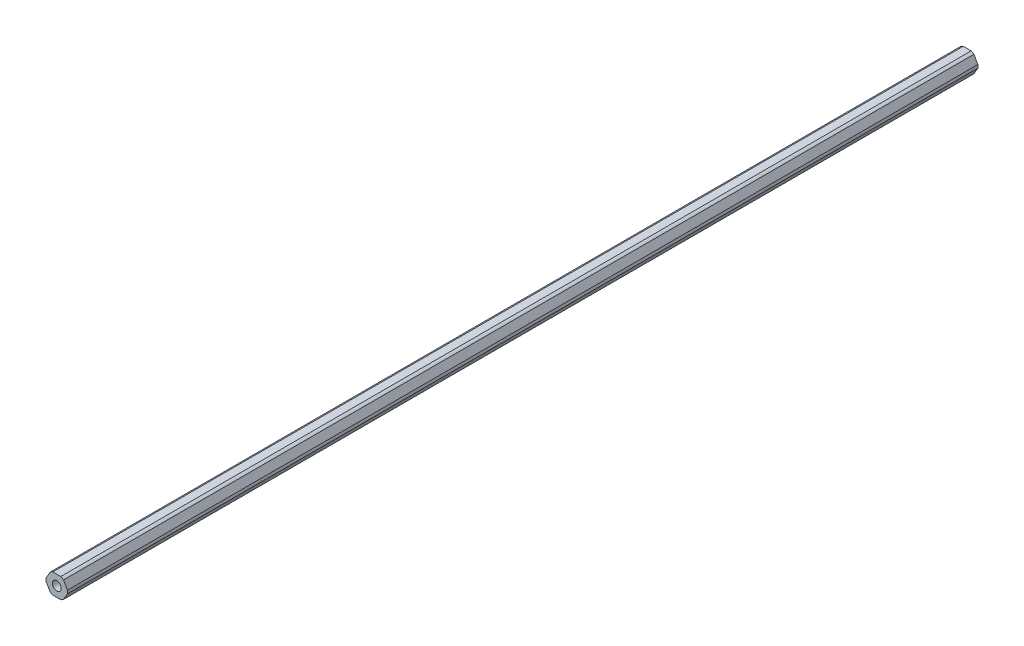
ISO-10303-21;
HEADER;
FILE_DESCRIPTION(('STEP AP214'),'2;1');
FILE_NAME('part.step','',(''),(''),'','','');
FILE_SCHEMA(('AUTOMOTIVE_DESIGN { 1 0 10303 214 1 1 1 1 }'));
ENDSEC;
DATA;
#1=APPLICATION_CONTEXT('core data for automotive mechanical design processes');
#2=APPLICATION_PROTOCOL_DEFINITION('international standard','automotive_design',2000,#1);
#3=PRODUCT_CONTEXT('',#1,'mechanical');
#4=PRODUCT('Part','Part','',(#3));
#5=PRODUCT_RELATED_PRODUCT_CATEGORY('part','',(#4));
#6=PRODUCT_DEFINITION_FORMATION('','',#4);
#7=PRODUCT_DEFINITION_CONTEXT('part definition',#1,'design');
#8=PRODUCT_DEFINITION('design','',#6,#7);
#9=PRODUCT_DEFINITION_SHAPE('','',#8);
#10=(LENGTH_UNIT() NAMED_UNIT(*) SI_UNIT(.MILLI.,.METRE.));
#11=(NAMED_UNIT(*) PLANE_ANGLE_UNIT() SI_UNIT($,.RADIAN.));
#12=(NAMED_UNIT(*) SI_UNIT($,.STERADIAN.) SOLID_ANGLE_UNIT());
#13=UNCERTAINTY_MEASURE_WITH_UNIT(LENGTH_MEASURE(1.E-05),#10,'distance_accuracy_value','');
#14=(GEOMETRIC_REPRESENTATION_CONTEXT(3) GLOBAL_UNCERTAINTY_ASSIGNED_CONTEXT((#13)) GLOBAL_UNIT_ASSIGNED_CONTEXT((#10,
#11,#12)) REPRESENTATION_CONTEXT('',''));
#15=CARTESIAN_POINT('',(0.,0.,0.));
#16=DIRECTION('',(0.,0.,1.));
#17=DIRECTION('',(1.,0.,0.));
#18=AXIS2_PLACEMENT_3D('',#15,#16,#17);
#19=CARTESIAN_POINT('',(2.74963065701564,-4.7625,457.2));
#20=DIRECTION('',(-0.866025403784442,0.5,0.));
#21=DIRECTION('',(0.,0.,1.));
#22=AXIS2_PLACEMENT_3D('',#19,#20,#21);
#23=PLANE('',#22);
#24=DIRECTION('',(0.499999999999991,0.866025403784444,0.));
#25=VECTOR('',#24,1.);
#26=CARTESIAN_POINT('',(3.18463300545771,-4.00905383108654,-254.));
#27=LINE('',#26,#25);
#28=CARTESIAN_POINT('',(3.18463300545771,-4.00905383108654,-254.));
#29=VERTEX_POINT('',#28);
#30=CARTESIAN_POINT('',(5.06425896558911,-0.753446168913433,-254.));
#31=VERTEX_POINT('',#30);
#32=EDGE_CURVE('E233',#29,#31,#27,.T.);
#33=ORIENTED_EDGE('',*,*,#32,.F.);
#34=DIRECTION('',(0.,0.,1.));
#35=VECTOR('',#34,1.);
#36=CARTESIAN_POINT('',(3.1846330054577,-4.00905383108652,-457.2));
#37=LINE('',#36,#35);
#38=CARTESIAN_POINT('',(3.1846330054577,-4.00905383108653,-685.799999999999));
#39=VERTEX_POINT('',#38);
#40=EDGE_CURVE('E244',#39,#29,#37,.T.);
#41=ORIENTED_EDGE('',*,*,#40,.F.);
#42=DIRECTION('',(-0.499999999999995,-0.866025403784442,0.));
#43=VECTOR('',#42,1.);
#44=CARTESIAN_POINT('',(5.06425896558911,-0.753446168913432,-685.799999999999));
#45=LINE('',#44,#43);
#46=CARTESIAN_POINT('',(5.06425896558911,-0.753446168913432,-685.799999999999));
#47=VERTEX_POINT('',#46);
#48=EDGE_CURVE('E206',#47,#39,#45,.T.);
#49=ORIENTED_EDGE('',*,*,#48,.F.);
#50=DIRECTION('',(0.,0.,-1.));
#51=VECTOR('',#50,1.);
#52=CARTESIAN_POINT('',(5.06425896558911,-0.753446168913433,-457.2));
#53=LINE('',#52,#51);
#54=EDGE_CURVE('E261',#31,#47,#53,.T.);
#55=ORIENTED_EDGE('',*,*,#54,.F.);
#56=EDGE_LOOP('',(#33,#41,#49,#55));
#57=FACE_BOUND('',#56,.T.);
#58=ADVANCED_FACE('F46',(#57),#23,.F.);
#59=CARTESIAN_POINT('',(5.49926131403117,0.,457.2));
#60=DIRECTION('',(-0.866025403784438,-0.5,0.));
#61=DIRECTION('',(-0.5,0.866025403784438,0.));
#62=AXIS2_PLACEMENT_3D('',#59,#60,#61);
#63=PLANE('',#62);
#64=DIRECTION('',(-0.500000000000001,0.866025403784438,0.));
#65=VECTOR('',#64,1.);
#66=CARTESIAN_POINT('',(5.06425896558911,0.753446168913416,-254.));
#67=LINE('',#66,#65);
#68=CARTESIAN_POINT('',(5.06425896558911,0.753446168913416,-254.));
#69=VERTEX_POINT('',#68);
#70=CARTESIAN_POINT('',(3.18463300545762,4.00905383108658,-254.));
#71=VERTEX_POINT('',#70);
#72=EDGE_CURVE('E63',#69,#71,#67,.T.);
#73=ORIENTED_EDGE('',*,*,#72,.F.);
#74=DIRECTION('',(0.,0.,1.));
#75=VECTOR('',#74,1.);
#76=CARTESIAN_POINT('',(5.06425896558911,0.753446168913412,-457.2));
#77=LINE('',#76,#75);
#78=CARTESIAN_POINT('',(5.06425896558911,0.753446168913415,-685.799999999999));
#79=VERTEX_POINT('',#78);
#80=EDGE_CURVE('E259',#79,#69,#77,.T.);
#81=ORIENTED_EDGE('',*,*,#80,.F.);
#82=DIRECTION('',(0.499999999999999,-0.866025403784439,0.));
#83=VECTOR('',#82,1.);
#84=CARTESIAN_POINT('',(3.18463300545764,4.00905383108656,-685.799999999999));
#85=LINE('',#84,#83);
#86=CARTESIAN_POINT('',(3.18463300545763,4.00905383108658,-685.799999999999));
#87=VERTEX_POINT('',#86);
#88=EDGE_CURVE('E177',#87,#79,#85,.T.);
#89=ORIENTED_EDGE('',*,*,#88,.F.);
#90=DIRECTION('',(0.,0.,-1.));
#91=VECTOR('',#90,1.);
#92=CARTESIAN_POINT('',(3.18463300545762,4.00905383108658,-457.2));
#93=LINE('',#92,#91);
#94=EDGE_CURVE('E166',#71,#87,#93,.T.);
#95=ORIENTED_EDGE('',*,*,#94,.F.);
#96=EDGE_LOOP('',(#73,#81,#89,#95));
#97=FACE_BOUND('',#96,.T.);
#98=ADVANCED_FACE('F287',(#97),#63,.F.);
#99=CARTESIAN_POINT('',(2.74963065701557,4.7625,457.2));
#100=DIRECTION('',(0.,-1.,0.));
#101=DIRECTION('',(0.,0.,-1.));
#102=AXIS2_PLACEMENT_3D('',#99,#100,#101);
#103=PLANE('',#102);
#104=DIRECTION('',(-1.,0.,0.));
#105=VECTOR('',#104,1.);
#106=CARTESIAN_POINT('',(1.87962596013146,4.76249999999999,-254.));
#107=LINE('',#106,#105);
#108=CARTESIAN_POINT('',(1.87962596013146,4.76249999999999,-254.));
#109=VERTEX_POINT('',#108);
#110=CARTESIAN_POINT('',(-1.8796259601315,4.7625,-254.));
#111=VERTEX_POINT('',#110);
#112=EDGE_CURVE('E163',#109,#111,#107,.T.);
#113=ORIENTED_EDGE('',*,*,#112,.F.);
#114=DIRECTION('',(0.,0.,1.));
#115=VECTOR('',#114,1.);
#116=CARTESIAN_POINT('',(1.87962596013147,4.7625,-457.2));
#117=LINE('',#116,#115);
#118=CARTESIAN_POINT('',(1.87962596013146,4.76249999999999,-685.799999999999));
#119=VERTEX_POINT('',#118);
#120=EDGE_CURVE('E156',#119,#109,#117,.T.);
#121=ORIENTED_EDGE('',*,*,#120,.F.);
#122=DIRECTION('',(1.,0.,0.));
#123=VECTOR('',#122,1.);
#124=CARTESIAN_POINT('',(-1.87962596013148,4.76249999999999,-685.799999999999));
#125=LINE('',#124,#123);
#126=CARTESIAN_POINT('',(-1.8796259601315,4.76249999999999,-685.799999999999));
#127=VERTEX_POINT('',#126);
#128=EDGE_CURVE('E161',#127,#119,#125,.T.);
#129=ORIENTED_EDGE('',*,*,#128,.F.);
#130=DIRECTION('',(0.,0.,-1.));
#131=VECTOR('',#130,1.);
#132=CARTESIAN_POINT('',(-1.8796259601315,4.7625,-457.2));
#133=LINE('',#132,#131);
#134=EDGE_CURVE('E241',#111,#127,#133,.T.);
#135=ORIENTED_EDGE('',*,*,#134,.F.);
#136=EDGE_LOOP('',(#113,#121,#129,#135));
#137=FACE_BOUND('',#136,.T.);
#138=ADVANCED_FACE('F158',(#137),#103,.F.);
#139=CARTESIAN_POINT('',(-2.7496306570156,4.7625,457.2));
#140=DIRECTION('',(0.866025403784442,-0.5,0.));
#141=DIRECTION('',(0.,0.,-1.));
#142=AXIS2_PLACEMENT_3D('',#139,#140,#141);
#143=PLANE('',#142);
#144=DIRECTION('',(-0.499999999999993,-0.866025403784443,0.));
#145=VECTOR('',#144,1.);
#146=CARTESIAN_POINT('',(-3.18463300545766,4.00905383108656,-254.));
#147=LINE('',#146,#145);
#148=CARTESIAN_POINT('',(-3.18463300545767,4.00905383108657,-254.));
#149=VERTEX_POINT('',#148);
#150=CARTESIAN_POINT('',(-5.06425896558912,0.753446168913382,-254.));
#151=VERTEX_POINT('',#150);
#152=EDGE_CURVE('E221',#149,#151,#147,.T.);
#153=ORIENTED_EDGE('',*,*,#152,.F.);
#154=DIRECTION('',(0.,0.,1.));
#155=VECTOR('',#154,1.);
#156=CARTESIAN_POINT('',(-3.18463300545766,4.00905383108655,-457.2));
#157=LINE('',#156,#155);
#158=CARTESIAN_POINT('',(-3.18463300545766,4.00905383108656,-685.799999999999));
#159=VERTEX_POINT('',#158);
#160=EDGE_CURVE('E246',#159,#149,#157,.T.);
#161=ORIENTED_EDGE('',*,*,#160,.F.);
#162=DIRECTION('',(0.499999999999995,0.866025403784441,0.));
#163=VECTOR('',#162,1.);
#164=CARTESIAN_POINT('',(-5.06425896558912,0.753446168913382,-685.799999999999));
#165=LINE('',#164,#163);
#166=CARTESIAN_POINT('',(-5.06425896558912,0.753446168913381,-685.799999999999));
#167=VERTEX_POINT('',#166);
#168=EDGE_CURVE('E185',#167,#159,#165,.T.);
#169=ORIENTED_EDGE('',*,*,#168,.F.);
#170=DIRECTION('',(0.,0.,-1.));
#171=VECTOR('',#170,1.);
#172=CARTESIAN_POINT('',(-5.06425896558912,0.753446168913382,-457.2));
#173=LINE('',#172,#171);
#174=EDGE_CURVE('E240',#151,#167,#173,.T.);
#175=ORIENTED_EDGE('',*,*,#174,.F.);
#176=EDGE_LOOP('',(#153,#161,#169,#175));
#177=FACE_BOUND('',#176,.T.);
#178=ADVANCED_FACE('F317',(#177),#143,.F.);
#179=CARTESIAN_POINT('',(-5.49926131403117,0.,457.2));
#180=DIRECTION('',(0.866025403784435,0.500000000000007,0.));
#181=DIRECTION('',(0.,0.,-1.));
#182=AXIS2_PLACEMENT_3D('',#179,#180,#181);
#183=PLANE('',#182);
#184=DIRECTION('',(0.500000000000007,-0.866025403784435,0.));
#185=VECTOR('',#184,1.);
#186=CARTESIAN_POINT('',(-5.06425896558911,-0.753446168913448,-254.));
#187=LINE('',#186,#185);
#188=CARTESIAN_POINT('',(-5.06425896558911,-0.753446168913446,-254.));
#189=VERTEX_POINT('',#188);
#190=CARTESIAN_POINT('',(-3.1846330054576,-4.0090538310866,-254.));
#191=VERTEX_POINT('',#190);
#192=EDGE_CURVE('E225',#189,#191,#187,.T.);
#193=ORIENTED_EDGE('',*,*,#192,.F.);
#194=DIRECTION('',(0.,0.,1.));
#195=VECTOR('',#194,1.);
#196=CARTESIAN_POINT('',(-5.06425896558911,-0.75344616891345,-457.2));
#197=LINE('',#196,#195);
#198=CARTESIAN_POINT('',(-5.06425896558911,-0.75344616891345,-685.799999999999));
#199=VERTEX_POINT('',#198);
#200=EDGE_CURVE('E236',#199,#189,#197,.T.);
#201=ORIENTED_EDGE('',*,*,#200,.F.);
#202=DIRECTION('',(-0.500000000000007,0.866025403784434,0.));
#203=VECTOR('',#202,1.);
#204=CARTESIAN_POINT('',(-3.18463300545759,-4.00905383108661,-685.799999999999));
#205=LINE('',#204,#203);
#206=CARTESIAN_POINT('',(-3.1846330054576,-4.0090538310866,-685.799999999999));
#207=VERTEX_POINT('',#206);
#208=EDGE_CURVE('E194',#207,#199,#205,.T.);
#209=ORIENTED_EDGE('',*,*,#208,.F.);
#210=DIRECTION('',(0.,0.,-1.));
#211=VECTOR('',#210,1.);
#212=CARTESIAN_POINT('',(-3.1846330054576,-4.0090538310866,-457.2));
#213=LINE('',#212,#211);
#214=EDGE_CURVE('E245',#191,#207,#213,.T.);
#215=ORIENTED_EDGE('',*,*,#214,.F.);
#216=EDGE_LOOP('',(#193,#201,#209,#215));
#217=FACE_BOUND('',#216,.T.);
#218=ADVANCED_FACE('F308',(#217),#183,.F.);
#219=CARTESIAN_POINT('',(-2.74963065701554,-4.7625,457.2));
#220=DIRECTION('',(0.,1.,0.));
#221=DIRECTION('',(1.,0.,0.));
#222=AXIS2_PLACEMENT_3D('',#219,#220,#221);
#223=PLANE('',#222);
#224=DIRECTION('',(1.,0.,0.));
#225=VECTOR('',#224,1.);
#226=CARTESIAN_POINT('',(-1.87962596013144,-4.7625,-254.));
#227=LINE('',#226,#225);
#228=CARTESIAN_POINT('',(-1.87962596013144,-4.7625,-254.));
#229=VERTEX_POINT('',#228);
#230=CARTESIAN_POINT('',(1.87962596013154,-4.7625,-254.));
#231=VERTEX_POINT('',#230);
#232=EDGE_CURVE('E229',#229,#231,#227,.T.);
#233=ORIENTED_EDGE('',*,*,#232,.F.);
#234=DIRECTION('',(0.,0.,1.));
#235=VECTOR('',#234,1.);
#236=CARTESIAN_POINT('',(-1.87962596013144,-4.7625,-457.2));
#237=LINE('',#236,#235);
#238=CARTESIAN_POINT('',(-1.87962596013143,-4.7625,-685.799999999999));
#239=VERTEX_POINT('',#238);
#240=EDGE_CURVE('E249',#239,#229,#237,.T.);
#241=ORIENTED_EDGE('',*,*,#240,.F.);
#242=DIRECTION('',(-1.,0.,0.));
#243=VECTOR('',#242,1.);
#244=CARTESIAN_POINT('',(1.87962596013155,-4.76249999999998,-685.799999999999));
#245=LINE('',#244,#243);
#246=CARTESIAN_POINT('',(1.87962596013153,-4.76249999999998,-685.799999999999));
#247=VERTEX_POINT('',#246);
#248=EDGE_CURVE('E200',#247,#239,#245,.T.);
#249=ORIENTED_EDGE('',*,*,#248,.F.);
#250=DIRECTION('',(0.,0.,-1.));
#251=VECTOR('',#250,1.);
#252=CARTESIAN_POINT('',(1.87962596013154,-4.7625,-457.2));
#253=LINE('',#252,#251);
#254=EDGE_CURVE('E242',#231,#247,#253,.T.);
#255=ORIENTED_EDGE('',*,*,#254,.F.);
#256=EDGE_LOOP('',(#233,#241,#249,#255));
#257=FACE_BOUND('',#256,.T.);
#258=ADVANCED_FACE('F300',(#257),#223,.F.);
#259=CARTESIAN_POINT('',(0.,0.,-457.2));
#260=DIRECTION('',(0.,0.,1.));
#261=DIRECTION('',(1.,0.,0.));
#262=AXIS2_PLACEMENT_3D('',#259,#260,#261);
#263=CYLINDRICAL_SURFACE('',#262,5.12);
#264=ORIENTED_EDGE('',*,*,#80,.T.);
#265=CARTESIAN_POINT('',(0.,0.,-254.));
#266=DIRECTION('',(0.,0.,1.));
#267=DIRECTION('',(1.,0.,0.));
#268=AXIS2_PLACEMENT_3D('',#265,#266,#267);
#269=CIRCLE('',#268,5.12);
#270=CARTESIAN_POINT('',(5.12,0.,-254.));
#271=VERTEX_POINT('',#270);
#272=EDGE_CURVE('E176',#271,#69,#269,.T.);
#273=ORIENTED_EDGE('',*,*,#272,.F.);
#274=DIRECTION('',(0.,0.,1.));
#275=VECTOR('',#274,1.);
#276=CARTESIAN_POINT('',(5.12,0.,-457.2));
#277=LINE('',#276,#275);
#278=CARTESIAN_POINT('',(5.12,0.,-457.2));
#279=VERTEX_POINT('',#278);
#280=EDGE_CURVE('E263',#279,#271,#277,.T.);
#281=ORIENTED_EDGE('',*,*,#280,.F.);
#282=ORIENTED_EDGE('',*,*,#280,.T.);
#283=EDGE_CURVE('E213',#31,#271,#269,.T.);
#284=ORIENTED_EDGE('',*,*,#283,.F.);
#285=ORIENTED_EDGE('',*,*,#54,.T.);
#286=CARTESIAN_POINT('',(0.,0.,-685.799999999999));
#287=DIRECTION('',(0.,0.,-1.));
#288=DIRECTION('',(-1.,0.,0.));
#289=AXIS2_PLACEMENT_3D('',#286,#287,#288);
#290=CIRCLE('',#289,5.12);
#291=EDGE_CURVE('E209',#79,#47,#290,.T.);
#292=ORIENTED_EDGE('',*,*,#291,.F.);
#293=EDGE_LOOP('',(#264,#273,#281,#282,#284,#285,#292));
#294=FACE_BOUND('',#293,.T.);
#295=ADVANCED_FACE('F48',(#294),#263,.T.);
#296=CARTESIAN_POINT('',(0.,0.,-457.2));
#297=DIRECTION('',(0.,0.,1.));
#298=DIRECTION('',(1.,0.,0.));
#299=AXIS2_PLACEMENT_3D('',#296,#297,#298);
#300=CYLINDRICAL_SURFACE('',#299,5.12);
#301=ORIENTED_EDGE('',*,*,#40,.T.);
#302=CARTESIAN_POINT('',(0.,0.,-254.));
#303=DIRECTION('',(0.,0.,1.));
#304=DIRECTION('',(1.,0.,0.));
#305=AXIS2_PLACEMENT_3D('',#302,#303,#304);
#306=CIRCLE('',#305,5.12000000000003);
#307=EDGE_CURVE('E231',#231,#29,#306,.T.);
#308=ORIENTED_EDGE('',*,*,#307,.F.);
#309=ORIENTED_EDGE('',*,*,#254,.T.);
#310=CARTESIAN_POINT('',(0.,0.,-685.799999999999));
#311=DIRECTION('',(0.,0.,-1.));
#312=DIRECTION('',(-1.,0.,0.));
#313=AXIS2_PLACEMENT_3D('',#310,#311,#312);
#314=CIRCLE('',#313,5.12000000000001);
#315=EDGE_CURVE('E203',#39,#247,#314,.T.);
#316=ORIENTED_EDGE('',*,*,#315,.F.);
#317=EDGE_LOOP('',(#301,#308,#309,#316));
#318=FACE_BOUND('',#317,.T.);
#319=ADVANCED_FACE('F294',(#318),#300,.T.);
#320=CARTESIAN_POINT('',(0.,0.,-457.2));
#321=DIRECTION('',(0.,0.,1.));
#322=DIRECTION('',(1.,0.,0.));
#323=AXIS2_PLACEMENT_3D('',#320,#321,#322);
#324=CYLINDRICAL_SURFACE('',#323,5.12);
#325=ORIENTED_EDGE('',*,*,#240,.T.);
#326=CARTESIAN_POINT('',(0.,0.,-254.));
#327=DIRECTION('',(0.,0.,1.));
#328=DIRECTION('',(1.,0.,0.));
#329=AXIS2_PLACEMENT_3D('',#326,#327,#328);
#330=CIRCLE('',#329,5.12);
#331=EDGE_CURVE('E227',#191,#229,#330,.T.);
#332=ORIENTED_EDGE('',*,*,#331,.F.);
#333=ORIENTED_EDGE('',*,*,#214,.T.);
#334=CARTESIAN_POINT('',(0.,0.,-685.799999999999));
#335=DIRECTION('',(0.,0.,-1.));
#336=DIRECTION('',(-1.,0.,0.));
#337=AXIS2_PLACEMENT_3D('',#334,#335,#336);
#338=CIRCLE('',#337,5.12);
#339=EDGE_CURVE('E197',#239,#207,#338,.T.);
#340=ORIENTED_EDGE('',*,*,#339,.F.);
#341=EDGE_LOOP('',(#325,#332,#333,#340));
#342=FACE_BOUND('',#341,.T.);
#343=ADVANCED_FACE('F303',(#342),#324,.T.);
#344=CARTESIAN_POINT('',(0.,0.,-457.2));
#345=DIRECTION('',(0.,0.,1.));
#346=DIRECTION('',(1.,0.,0.));
#347=AXIS2_PLACEMENT_3D('',#344,#345,#346);
#348=CYLINDRICAL_SURFACE('',#347,5.12);
#349=ORIENTED_EDGE('',*,*,#200,.T.);
#350=CARTESIAN_POINT('',(0.,0.,-254.));
#351=DIRECTION('',(0.,0.,1.));
#352=DIRECTION('',(1.,0.,0.));
#353=AXIS2_PLACEMENT_3D('',#350,#351,#352);
#354=CIRCLE('',#353,5.12);
#355=EDGE_CURVE('E223',#151,#189,#354,.T.);
#356=ORIENTED_EDGE('',*,*,#355,.F.);
#357=ORIENTED_EDGE('',*,*,#174,.T.);
#358=CARTESIAN_POINT('',(0.,0.,-685.799999999999));
#359=DIRECTION('',(0.,0.,-1.));
#360=DIRECTION('',(-1.,0.,0.));
#361=AXIS2_PLACEMENT_3D('',#358,#359,#360);
#362=CIRCLE('',#361,5.12);
#363=EDGE_CURVE('E191',#199,#167,#362,.T.);
#364=ORIENTED_EDGE('',*,*,#363,.F.);
#365=EDGE_LOOP('',(#349,#356,#357,#364));
#366=FACE_BOUND('',#365,.T.);
#367=ADVANCED_FACE('F312',(#366),#348,.T.);
#368=CARTESIAN_POINT('',(0.,0.,-457.2));
#369=DIRECTION('',(0.,0.,1.));
#370=DIRECTION('',(1.,0.,0.));
#371=AXIS2_PLACEMENT_3D('',#368,#369,#370);
#372=CYLINDRICAL_SURFACE('',#371,5.12);
#373=ORIENTED_EDGE('',*,*,#160,.T.);
#374=CARTESIAN_POINT('',(0.,0.,-254.));
#375=DIRECTION('',(0.,0.,1.));
#376=DIRECTION('',(1.,0.,0.));
#377=AXIS2_PLACEMENT_3D('',#374,#375,#376);
#378=CIRCLE('',#377,5.12000000000002);
#379=EDGE_CURVE('E219',#111,#149,#378,.T.);
#380=ORIENTED_EDGE('',*,*,#379,.F.);
#381=ORIENTED_EDGE('',*,*,#134,.T.);
#382=CARTESIAN_POINT('',(0.,0.,-685.799999999999));
#383=DIRECTION('',(0.,0.,-1.));
#384=DIRECTION('',(-1.,0.,0.));
#385=AXIS2_PLACEMENT_3D('',#382,#383,#384);
#386=CIRCLE('',#385,5.12000000000001);
#387=EDGE_CURVE('E182',#159,#127,#386,.T.);
#388=ORIENTED_EDGE('',*,*,#387,.F.);
#389=EDGE_LOOP('',(#373,#380,#381,#388));
#390=FACE_BOUND('',#389,.T.);
#391=ADVANCED_FACE('F320',(#390),#372,.T.);
#392=CARTESIAN_POINT('',(0.,0.,-457.2));
#393=DIRECTION('',(0.,0.,1.));
#394=DIRECTION('',(1.,0.,0.));
#395=AXIS2_PLACEMENT_3D('',#392,#393,#394);
#396=CYLINDRICAL_SURFACE('',#395,5.12);
#397=ORIENTED_EDGE('',*,*,#120,.T.);
#398=CARTESIAN_POINT('',(0.,0.,-254.));
#399=DIRECTION('',(0.,0.,1.));
#400=DIRECTION('',(1.,0.,0.));
#401=AXIS2_PLACEMENT_3D('',#398,#399,#400);
#402=CIRCLE('',#401,5.12);
#403=EDGE_CURVE('E216',#71,#109,#402,.T.);
#404=ORIENTED_EDGE('',*,*,#403,.F.);
#405=ORIENTED_EDGE('',*,*,#94,.T.);
#406=CARTESIAN_POINT('',(0.,0.,-685.799999999999));
#407=DIRECTION('',(0.,0.,-1.));
#408=DIRECTION('',(-1.,0.,0.));
#409=AXIS2_PLACEMENT_3D('',#406,#407,#408);
#410=CIRCLE('',#409,5.12000000000001);
#411=EDGE_CURVE('E170',#119,#87,#410,.T.);
#412=ORIENTED_EDGE('',*,*,#411,.F.);
#413=EDGE_LOOP('',(#397,#404,#405,#412));
#414=FACE_BOUND('',#413,.T.);
#415=ADVANCED_FACE('F171',(#414),#396,.T.);
#416=CARTESIAN_POINT('',(0.,0.,-457.2));
#417=DIRECTION('',(0.,0.,1.));
#418=DIRECTION('',(1.,0.,0.));
#419=AXIS2_PLACEMENT_3D('',#416,#417,#418);
#420=CYLINDRICAL_SURFACE('',#419,2.1);
#421=CARTESIAN_POINT('',(0.,0.,-254.));
#422=DIRECTION('',(0.,0.,1.));
#423=DIRECTION('',(1.,0.,0.));
#424=AXIS2_PLACEMENT_3D('',#421,#422,#423);
#425=CIRCLE('',#424,2.1);
#426=CARTESIAN_POINT('',(-2.1,0.,-254.));
#427=VERTEX_POINT('',#426);
#428=CARTESIAN_POINT('',(2.1,0.,-254.));
#429=VERTEX_POINT('',#428);
#430=EDGE_CURVE('E11',#427,#429,#425,.F.);
#431=ORIENTED_EDGE('',*,*,#430,.F.);
#432=DIRECTION('',(0.,0.,1.));
#433=VECTOR('',#432,1.);
#434=CARTESIAN_POINT('',(-2.1,0.,-457.2));
#435=LINE('',#434,#433);
#436=CARTESIAN_POINT('',(-2.1,0.,-457.2));
#437=VERTEX_POINT('',#436);
#438=EDGE_CURVE('E55',#437,#427,#435,.T.);
#439=ORIENTED_EDGE('',*,*,#438,.F.);
#440=ORIENTED_EDGE('',*,*,#438,.T.);
#441=CARTESIAN_POINT('',(0.,0.,-254.));
#442=DIRECTION('',(0.,0.,1.));
#443=DIRECTION('',(1.,0.,0.));
#444=AXIS2_PLACEMENT_3D('',#441,#442,#443);
#445=CIRCLE('',#444,2.1);
#446=EDGE_CURVE('E69',#429,#427,#445,.F.);
#447=ORIENTED_EDGE('',*,*,#446,.F.);
#448=DIRECTION('',(0.,0.,1.));
#449=VECTOR('',#448,1.);
#450=CARTESIAN_POINT('',(2.1,0.,-457.2));
#451=LINE('',#450,#449);
#452=CARTESIAN_POINT('',(2.1,0.,-457.2));
#453=VERTEX_POINT('',#452);
#454=EDGE_CURVE('E167',#453,#429,#451,.T.);
#455=ORIENTED_EDGE('',*,*,#454,.F.);
#456=ORIENTED_EDGE('',*,*,#454,.T.);
#457=EDGE_LOOP('',(#431,#439,#440,#447,#455,#456));
#458=FACE_BOUND('',#457,.T.);
#459=CARTESIAN_POINT('',(0.,0.,-685.799999999999));
#460=DIRECTION('',(0.,0.,-1.));
#461=DIRECTION('',(-1.,0.,0.));
#462=AXIS2_PLACEMENT_3D('',#459,#460,#461);
#463=CIRCLE('',#462,2.1);
#464=CARTESIAN_POINT('',(-2.1,0.,-685.799999999999));
#465=VERTEX_POINT('',#464);
#466=EDGE_CURVE('E183',#465,#465,#463,.T.);
#467=ORIENTED_EDGE('',*,*,#466,.T.);
#468=EDGE_LOOP('',(#467));
#469=FACE_BOUND('',#468,.T.);
#470=ADVANCED_FACE('F327',(#458,#469),#420,.F.);
#471=CARTESIAN_POINT('',(0.,0.,-254.));
#472=DIRECTION('',(0.,0.,1.));
#473=DIRECTION('',(1.,0.,0.));
#474=AXIS2_PLACEMENT_3D('',#471,#472,#473);
#475=PLANE('',#474);
#476=ORIENTED_EDGE('',*,*,#283,.T.);
#477=ORIENTED_EDGE('',*,*,#272,.T.);
#478=ORIENTED_EDGE('',*,*,#72,.T.);
#479=ORIENTED_EDGE('',*,*,#403,.T.);
#480=ORIENTED_EDGE('',*,*,#112,.T.);
#481=ORIENTED_EDGE('',*,*,#379,.T.);
#482=ORIENTED_EDGE('',*,*,#152,.T.);
#483=ORIENTED_EDGE('',*,*,#355,.T.);
#484=ORIENTED_EDGE('',*,*,#192,.T.);
#485=ORIENTED_EDGE('',*,*,#331,.T.);
#486=ORIENTED_EDGE('',*,*,#232,.T.);
#487=ORIENTED_EDGE('',*,*,#307,.T.);
#488=ORIENTED_EDGE('',*,*,#32,.T.);
#489=EDGE_LOOP('',(#476,#477,#478,#479,#480,#481,#482,#483,#484,#485,#486,#487,#488));
#490=FACE_BOUND('',#489,.T.);
#491=ORIENTED_EDGE('',*,*,#446,.T.);
#492=ORIENTED_EDGE('',*,*,#430,.T.);
#493=EDGE_LOOP('',(#491,#492));
#494=FACE_BOUND('',#493,.T.);
#495=ADVANCED_FACE('F285',(#490,#494),#475,.T.);
#496=CARTESIAN_POINT('',(7.13739999999967,12.3773394339421,-685.799999999999));
#497=DIRECTION('',(0.,0.,-1.));
#498=DIRECTION('',(-0.866025403784441,0.499999999999996,0.));
#499=AXIS2_PLACEMENT_3D('',#496,#497,#498);
#500=PLANE('',#499);
#501=ORIENTED_EDGE('',*,*,#466,.F.);
#502=EDGE_LOOP('',(#501));
#503=FACE_BOUND('',#502,.T.);
#504=ORIENTED_EDGE('',*,*,#128,.T.);
#505=ORIENTED_EDGE('',*,*,#411,.T.);
#506=ORIENTED_EDGE('',*,*,#88,.T.);
#507=ORIENTED_EDGE('',*,*,#291,.T.);
#508=ORIENTED_EDGE('',*,*,#48,.T.);
#509=ORIENTED_EDGE('',*,*,#315,.T.);
#510=ORIENTED_EDGE('',*,*,#248,.T.);
#511=ORIENTED_EDGE('',*,*,#339,.T.);
#512=ORIENTED_EDGE('',*,*,#208,.T.);
#513=ORIENTED_EDGE('',*,*,#363,.T.);
#514=ORIENTED_EDGE('',*,*,#168,.T.);
#515=ORIENTED_EDGE('',*,*,#387,.T.);
#516=EDGE_LOOP('',(#504,#505,#506,#507,#508,#509,#510,#511,#512,#513,#514,#515));
#517=FACE_BOUND('',#516,.T.);
#518=ADVANCED_FACE('F179',(#503,#517),#500,.T.);
#519=CLOSED_SHELL('',(#58,#98,#138,#178,#218,#258,#295,#319,#343,#367,#391,#415,#470,#495,#518));
#520=MANIFOLD_SOLID_BREP('B2',#519);
#521=ADVANCED_BREP_SHAPE_REPRESENTATION('',(#18,#520),#14);
#522=SHAPE_DEFINITION_REPRESENTATION(#9,#521);
ENDSEC;
END-ISO-10303-21;
